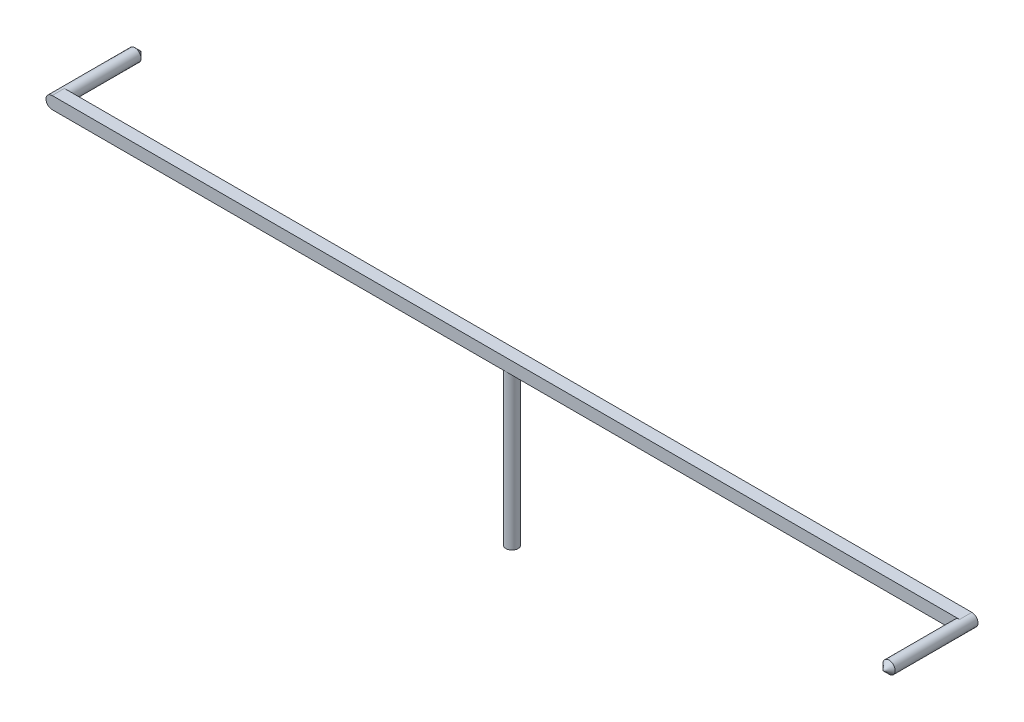
ISO-10303-21;
HEADER;
FILE_DESCRIPTION(('STEP AP214'),'2;1');
FILE_NAME('part.step','',(''),(''),'','','');
FILE_SCHEMA(('AUTOMOTIVE_DESIGN { 1 0 10303 214 1 1 1 1 }'));
ENDSEC;
DATA;
#1=APPLICATION_CONTEXT('core data for automotive mechanical design processes');
#2=APPLICATION_PROTOCOL_DEFINITION('international standard','automotive_design',2000,#1);
#3=PRODUCT_CONTEXT('',#1,'mechanical');
#4=PRODUCT('Part','Part','',(#3));
#5=PRODUCT_RELATED_PRODUCT_CATEGORY('part','',(#4));
#6=PRODUCT_DEFINITION_FORMATION('','',#4);
#7=PRODUCT_DEFINITION_CONTEXT('part definition',#1,'design');
#8=PRODUCT_DEFINITION('design','',#6,#7);
#9=PRODUCT_DEFINITION_SHAPE('','',#8);
#10=(LENGTH_UNIT() NAMED_UNIT(*) SI_UNIT(.MILLI.,.METRE.));
#11=(NAMED_UNIT(*) PLANE_ANGLE_UNIT() SI_UNIT($,.RADIAN.));
#12=(NAMED_UNIT(*) SI_UNIT($,.STERADIAN.) SOLID_ANGLE_UNIT());
#13=UNCERTAINTY_MEASURE_WITH_UNIT(LENGTH_MEASURE(1.E-05),#10,'distance_accuracy_value','');
#14=(GEOMETRIC_REPRESENTATION_CONTEXT(3) GLOBAL_UNCERTAINTY_ASSIGNED_CONTEXT((#13)) GLOBAL_UNIT_ASSIGNED_CONTEXT((#10,
#11,#12)) REPRESENTATION_CONTEXT('',''));
#15=CARTESIAN_POINT('',(0.,0.,0.));
#16=DIRECTION('',(0.,0.,1.));
#17=DIRECTION('',(1.,0.,0.));
#18=AXIS2_PLACEMENT_3D('',#15,#16,#17);
#19=CARTESIAN_POINT('',(0.,10.,0.));
#20=DIRECTION('',(0.,-1.,0.));
#21=DIRECTION('',(0.,0.,-1.));
#22=AXIS2_PLACEMENT_3D('',#19,#20,#21);
#23=CYLINDRICAL_SURFACE('',#22,0.4);
#24=CARTESIAN_POINT('',(0.,10.,0.));
#25=DIRECTION('',(0.,1.,0.));
#26=DIRECTION('',(0.,0.,1.));
#27=AXIS2_PLACEMENT_3D('',#24,#25,#26);
#28=CIRCLE('',#27,0.4);
#29=CARTESIAN_POINT('',(0.,10.,0.4));
#30=VERTEX_POINT('',#29);
#31=CARTESIAN_POINT('',(0.,10.,-0.4));
#32=VERTEX_POINT('',#31);
#33=EDGE_CURVE('E164',#30,#32,#28,.T.);
#34=ORIENTED_EDGE('',*,*,#33,.F.);
#35=EDGE_CURVE('E167',#32,#30,#28,.T.);
#36=ORIENTED_EDGE('',*,*,#35,.F.);
#37=EDGE_LOOP('',(#34,#36));
#38=FACE_BOUND('',#37,.T.);
#39=CARTESIAN_POINT('',(0.,0.,0.));
#40=DIRECTION('',(0.,1.,0.));
#41=DIRECTION('',(0.,0.,1.));
#42=AXIS2_PLACEMENT_3D('',#39,#40,#41);
#43=CIRCLE('',#42,0.4);
#44=CARTESIAN_POINT('',(0.,0.,0.4));
#45=VERTEX_POINT('',#44);
#46=EDGE_CURVE('E153',#45,#45,#43,.T.);
#47=ORIENTED_EDGE('',*,*,#46,.T.);
#48=EDGE_LOOP('',(#47));
#49=FACE_BOUND('',#48,.T.);
#50=ADVANCED_FACE('F35',(#38,#49),#23,.T.);
#51=CARTESIAN_POINT('',(0.,0.,0.));
#52=DIRECTION('',(0.,1.,0.));
#53=DIRECTION('',(0.,0.,1.));
#54=AXIS2_PLACEMENT_3D('',#51,#52,#53);
#55=PLANE('',#54);
#56=ORIENTED_EDGE('',*,*,#46,.F.);
#57=EDGE_LOOP('',(#56));
#58=FACE_BOUND('',#57,.T.);
#59=ADVANCED_FACE('F77',(#58),#55,.F.);
#60=CARTESIAN_POINT('',(0.,10.,0.));
#61=DIRECTION('',(0.,1.,0.));
#62=DIRECTION('',(0.,0.,1.));
#63=AXIS2_PLACEMENT_3D('',#60,#61,#62);
#64=PLANE('',#63);
#65=DIRECTION('',(-1.,0.,0.));
#66=VECTOR('',#65,1.);
#67=CARTESIAN_POINT('',(-30.,10.,-0.4));
#68=LINE('',#67,#66);
#69=CARTESIAN_POINT('',(29.6,10.,-0.4));
#70=VERTEX_POINT('',#69);
#71=EDGE_CURVE('E151',#70,#32,#68,.T.);
#72=ORIENTED_EDGE('',*,*,#71,.F.);
#73=DIRECTION('',(0.,0.,-1.));
#74=VECTOR('',#73,1.);
#75=CARTESIAN_POINT('',(29.6,10.,0.));
#76=LINE('',#75,#74);
#77=CARTESIAN_POINT('',(29.6,10.,0.4));
#78=VERTEX_POINT('',#77);
#79=EDGE_CURVE('E119',#70,#78,#76,.F.);
#80=ORIENTED_EDGE('',*,*,#79,.T.);
#81=DIRECTION('',(1.,0.,0.));
#82=VECTOR('',#81,1.);
#83=CARTESIAN_POINT('',(-30.,10.,0.4));
#84=LINE('',#83,#82);
#85=EDGE_CURVE('E128',#30,#78,#84,.T.);
#86=ORIENTED_EDGE('',*,*,#85,.F.);
#87=ORIENTED_EDGE('',*,*,#33,.T.);
#88=EDGE_LOOP('',(#72,#80,#86,#87));
#89=FACE_BOUND('',#88,.T.);
#90=ADVANCED_FACE('F83',(#89),#64,.F.);
#91=CARTESIAN_POINT('',(-29.6,10.,0.4));
#92=VERTEX_POINT('',#91);
#93=EDGE_CURVE('E161',#92,#30,#84,.T.);
#94=ORIENTED_EDGE('',*,*,#93,.F.);
#95=DIRECTION('',(0.,0.,1.));
#96=VECTOR('',#95,1.);
#97=CARTESIAN_POINT('',(-29.6,10.,0.));
#98=LINE('',#97,#96);
#99=CARTESIAN_POINT('',(-29.6,10.,-0.4));
#100=VERTEX_POINT('',#99);
#101=EDGE_CURVE('E173',#92,#100,#98,.F.);
#102=ORIENTED_EDGE('',*,*,#101,.T.);
#103=EDGE_CURVE('E156',#32,#100,#68,.T.);
#104=ORIENTED_EDGE('',*,*,#103,.F.);
#105=ORIENTED_EDGE('',*,*,#35,.T.);
#106=EDGE_LOOP('',(#94,#102,#104,#105));
#107=FACE_BOUND('',#106,.T.);
#108=ADVANCED_FACE('F179',(#107),#64,.F.);
#109=CARTESIAN_POINT('',(-30.,10.8,0.4));
#110=DIRECTION('',(0.,0.,-1.));
#111=DIRECTION('',(-1.,0.,0.));
#112=AXIS2_PLACEMENT_3D('',#109,#110,#111);
#113=PLANE('',#112);
#114=CARTESIAN_POINT('',(29.6,10.4,0.4));
#115=DIRECTION('',(0.,0.,1.));
#116=DIRECTION('',(1.,0.,0.));
#117=AXIS2_PLACEMENT_3D('',#114,#115,#116);
#118=CIRCLE('',#117,0.399999999999998);
#119=CARTESIAN_POINT('',(29.6,10.8,0.4));
#120=VERTEX_POINT('',#119);
#121=EDGE_CURVE('E108',#120,#78,#118,.T.);
#122=ORIENTED_EDGE('',*,*,#121,.F.);
#123=DIRECTION('',(1.,0.,0.));
#124=VECTOR('',#123,1.);
#125=CARTESIAN_POINT('',(-30.,10.8,0.4));
#126=LINE('',#125,#124);
#127=CARTESIAN_POINT('',(-29.6,10.8,0.4));
#128=VERTEX_POINT('',#127);
#129=EDGE_CURVE('E144',#128,#120,#126,.T.);
#130=ORIENTED_EDGE('',*,*,#129,.F.);
#131=CARTESIAN_POINT('',(-29.6,10.4,0.4));
#132=DIRECTION('',(0.,0.,-1.));
#133=DIRECTION('',(-1.,0.,0.));
#134=AXIS2_PLACEMENT_3D('',#131,#132,#133);
#135=CIRCLE('',#134,0.4);
#136=CARTESIAN_POINT('',(-30.,10.4,0.4));
#137=VERTEX_POINT('',#136);
#138=EDGE_CURVE('E142',#128,#137,#135,.F.);
#139=ORIENTED_EDGE('',*,*,#138,.T.);
#140=CARTESIAN_POINT('',(-29.6,10.4,0.4));
#141=DIRECTION('',(0.,0.,-1.));
#142=DIRECTION('',(-1.,0.,0.));
#143=AXIS2_PLACEMENT_3D('',#140,#141,#142);
#144=CIRCLE('',#143,0.4);
#145=EDGE_CURVE('E171',#137,#92,#144,.F.);
#146=ORIENTED_EDGE('',*,*,#145,.T.);
#147=ORIENTED_EDGE('',*,*,#93,.T.);
#148=ORIENTED_EDGE('',*,*,#85,.T.);
#149=EDGE_LOOP('',(#122,#130,#139,#146,#147,#148));
#150=FACE_BOUND('',#149,.T.);
#151=ADVANCED_FACE('F148',(#150),#113,.F.);
#152=CARTESIAN_POINT('',(-30.,10.8,-0.4));
#153=DIRECTION('',(0.,0.,1.));
#154=DIRECTION('',(1.,0.,0.));
#155=AXIS2_PLACEMENT_3D('',#152,#153,#154);
#156=PLANE('',#155);
#157=CARTESIAN_POINT('',(-29.6,10.4,-0.4));
#158=DIRECTION('',(0.,0.,-1.));
#159=DIRECTION('',(-1.,0.,0.));
#160=AXIS2_PLACEMENT_3D('',#157,#158,#159);
#161=CIRCLE('',#160,0.399999999999998);
#162=CARTESIAN_POINT('',(-29.6,10.8,-0.4));
#163=VERTEX_POINT('',#162);
#164=EDGE_CURVE('E139',#163,#100,#161,.T.);
#165=ORIENTED_EDGE('',*,*,#164,.F.);
#166=DIRECTION('',(-1.,0.,0.));
#167=VECTOR('',#166,1.);
#168=CARTESIAN_POINT('',(-30.,10.8,-0.4));
#169=LINE('',#168,#167);
#170=CARTESIAN_POINT('',(29.6,10.8,-0.4));
#171=VERTEX_POINT('',#170);
#172=EDGE_CURVE('E145',#171,#163,#169,.T.);
#173=ORIENTED_EDGE('',*,*,#172,.F.);
#174=CARTESIAN_POINT('',(29.6,10.4,-0.4));
#175=DIRECTION('',(0.,0.,1.));
#176=DIRECTION('',(1.,0.,0.));
#177=AXIS2_PLACEMENT_3D('',#174,#175,#176);
#178=CIRCLE('',#177,0.4);
#179=CARTESIAN_POINT('',(30.,10.4,-0.4));
#180=VERTEX_POINT('',#179);
#181=EDGE_CURVE('E52',#171,#180,#178,.F.);
#182=ORIENTED_EDGE('',*,*,#181,.T.);
#183=CARTESIAN_POINT('',(29.6,10.4,-0.4));
#184=DIRECTION('',(0.,0.,1.));
#185=DIRECTION('',(1.,0.,0.));
#186=AXIS2_PLACEMENT_3D('',#183,#184,#185);
#187=CIRCLE('',#186,0.4);
#188=EDGE_CURVE('E116',#180,#70,#187,.F.);
#189=ORIENTED_EDGE('',*,*,#188,.T.);
#190=ORIENTED_EDGE('',*,*,#71,.T.);
#191=ORIENTED_EDGE('',*,*,#103,.T.);
#192=EDGE_LOOP('',(#165,#173,#182,#189,#190,#191));
#193=FACE_BOUND('',#192,.T.);
#194=ADVANCED_FACE('F186',(#193),#156,.F.);
#195=CARTESIAN_POINT('',(0.,10.8,0.));
#196=DIRECTION('',(0.,1.,0.));
#197=DIRECTION('',(0.,0.,1.));
#198=AXIS2_PLACEMENT_3D('',#195,#196,#197);
#199=PLANE('',#198);
#200=ORIENTED_EDGE('',*,*,#172,.T.);
#201=DIRECTION('',(0.,0.,1.));
#202=VECTOR('',#201,1.);
#203=CARTESIAN_POINT('',(-29.6,10.8,0.4));
#204=LINE('',#203,#202);
#205=EDGE_CURVE('E115',#163,#128,#204,.T.);
#206=ORIENTED_EDGE('',*,*,#205,.T.);
#207=ORIENTED_EDGE('',*,*,#129,.T.);
#208=DIRECTION('',(0.,0.,-1.));
#209=VECTOR('',#208,1.);
#210=CARTESIAN_POINT('',(29.6,10.8,-0.4));
#211=LINE('',#210,#209);
#212=EDGE_CURVE('E104',#120,#171,#211,.T.);
#213=ORIENTED_EDGE('',*,*,#212,.T.);
#214=EDGE_LOOP('',(#200,#206,#207,#213));
#215=FACE_BOUND('',#214,.T.);
#216=ADVANCED_FACE('F93',(#215),#199,.T.);
#217=CARTESIAN_POINT('',(-29.6,10.4,0.));
#218=DIRECTION('',(0.,0.,-1.));
#219=DIRECTION('',(-1.,0.,0.));
#220=AXIS2_PLACEMENT_3D('',#217,#218,#219);
#221=CYLINDRICAL_SURFACE('',#220,0.4);
#222=CARTESIAN_POINT('',(-29.6,10.4,-5.));
#223=DIRECTION('',(0.,0.,-1.));
#224=DIRECTION('',(-1.,0.,0.));
#225=AXIS2_PLACEMENT_3D('',#222,#223,#224);
#226=CIRCLE('',#225,0.4);
#227=CARTESIAN_POINT('',(-30.,10.4,-5.));
#228=VERTEX_POINT('',#227);
#229=EDGE_CURVE('E44',#228,#228,#226,.F.);
#230=ORIENTED_EDGE('',*,*,#229,.T.);
#231=EDGE_LOOP('',(#230));
#232=FACE_BOUND('',#231,.T.);
#233=ORIENTED_EDGE('',*,*,#205,.F.);
#234=ORIENTED_EDGE('',*,*,#164,.T.);
#235=ORIENTED_EDGE('',*,*,#101,.F.);
#236=ORIENTED_EDGE('',*,*,#145,.F.);
#237=DIRECTION('',(0.,0.,1.));
#238=VECTOR('',#237,1.);
#239=CARTESIAN_POINT('',(-30.,10.4,-0.4));
#240=LINE('',#239,#238);
#241=CARTESIAN_POINT('',(-30.,10.4,-0.4));
#242=VERTEX_POINT('',#241);
#243=EDGE_CURVE('E126',#137,#242,#240,.F.);
#244=ORIENTED_EDGE('',*,*,#243,.T.);
#245=ORIENTED_EDGE('',*,*,#243,.F.);
#246=ORIENTED_EDGE('',*,*,#138,.F.);
#247=EDGE_LOOP('',(#233,#234,#235,#236,#244,#245,#246));
#248=FACE_BOUND('',#247,.T.);
#249=ADVANCED_FACE('F90',(#232,#248),#221,.T.);
#250=CARTESIAN_POINT('',(29.6,10.4,0.));
#251=DIRECTION('',(0.,0.,1.));
#252=DIRECTION('',(1.,0.,0.));
#253=AXIS2_PLACEMENT_3D('',#250,#251,#252);
#254=CYLINDRICAL_SURFACE('',#253,0.4);
#255=CARTESIAN_POINT('',(29.6,10.4,5.));
#256=DIRECTION('',(0.,0.,1.));
#257=DIRECTION('',(1.,0.,0.));
#258=AXIS2_PLACEMENT_3D('',#255,#256,#257);
#259=CIRCLE('',#258,0.4);
#260=CARTESIAN_POINT('',(30.,10.4,5.));
#261=VERTEX_POINT('',#260);
#262=EDGE_CURVE('E11',#261,#261,#259,.F.);
#263=ORIENTED_EDGE('',*,*,#262,.T.);
#264=EDGE_LOOP('',(#263));
#265=FACE_BOUND('',#264,.T.);
#266=ORIENTED_EDGE('',*,*,#212,.F.);
#267=ORIENTED_EDGE('',*,*,#121,.T.);
#268=ORIENTED_EDGE('',*,*,#79,.F.);
#269=ORIENTED_EDGE('',*,*,#188,.F.);
#270=DIRECTION('',(0.,0.,-1.));
#271=VECTOR('',#270,1.);
#272=CARTESIAN_POINT('',(30.,10.4,0.4));
#273=LINE('',#272,#271);
#274=CARTESIAN_POINT('',(30.,10.4,0.4));
#275=VERTEX_POINT('',#274);
#276=EDGE_CURVE('E129',#180,#275,#273,.F.);
#277=ORIENTED_EDGE('',*,*,#276,.T.);
#278=ORIENTED_EDGE('',*,*,#276,.F.);
#279=ORIENTED_EDGE('',*,*,#181,.F.);
#280=EDGE_LOOP('',(#266,#267,#268,#269,#277,#278,#279));
#281=FACE_BOUND('',#280,.T.);
#282=ADVANCED_FACE('F73',(#265,#281),#254,.T.);
#283=CARTESIAN_POINT('',(-29.6,10.4,-5.));
#284=DIRECTION('',(0.,0.,1.));
#285=DIRECTION('',(1.,0.,0.));
#286=AXIS2_PLACEMENT_3D('',#283,#284,#285);
#287=CONICAL_SURFACE('',#286,0.400000000000001,0.785398163397451);
#288=ORIENTED_EDGE('',*,*,#229,.F.);
#289=EDGE_LOOP('',(#288));
#290=FACE_BOUND('',#289,.T.);
#291=CARTESIAN_POINT('',(-29.6,10.4,-5.4));
#292=VERTEX_POINT('',#291);
#293=VERTEX_LOOP('',#292);
#294=FACE_BOUND('',#293,.T.);
#295=ADVANCED_FACE('F68',(#290,#294),#287,.T.);
#296=CARTESIAN_POINT('',(29.6,10.4,5.));
#297=DIRECTION('',(0.,0.,-1.));
#298=DIRECTION('',(-1.,0.,0.));
#299=AXIS2_PLACEMENT_3D('',#296,#297,#298);
#300=CONICAL_SURFACE('',#299,0.400000000000001,0.785398163397451);
#301=ORIENTED_EDGE('',*,*,#262,.F.);
#302=EDGE_LOOP('',(#301));
#303=FACE_BOUND('',#302,.T.);
#304=CARTESIAN_POINT('',(29.6,10.4,5.4));
#305=VERTEX_POINT('',#304);
#306=VERTEX_LOOP('',#305);
#307=FACE_BOUND('',#306,.T.);
#308=ADVANCED_FACE('F37',(#303,#307),#300,.T.);
#309=CLOSED_SHELL('',(#50,#59,#90,#108,#151,#194,#216,#249,#282,#295,#308));
#310=MANIFOLD_SOLID_BREP('B2',#309);
#311=ADVANCED_BREP_SHAPE_REPRESENTATION('',(#18,#310),#14);
#312=SHAPE_DEFINITION_REPRESENTATION(#9,#311);
ENDSEC;
END-ISO-10303-21;
